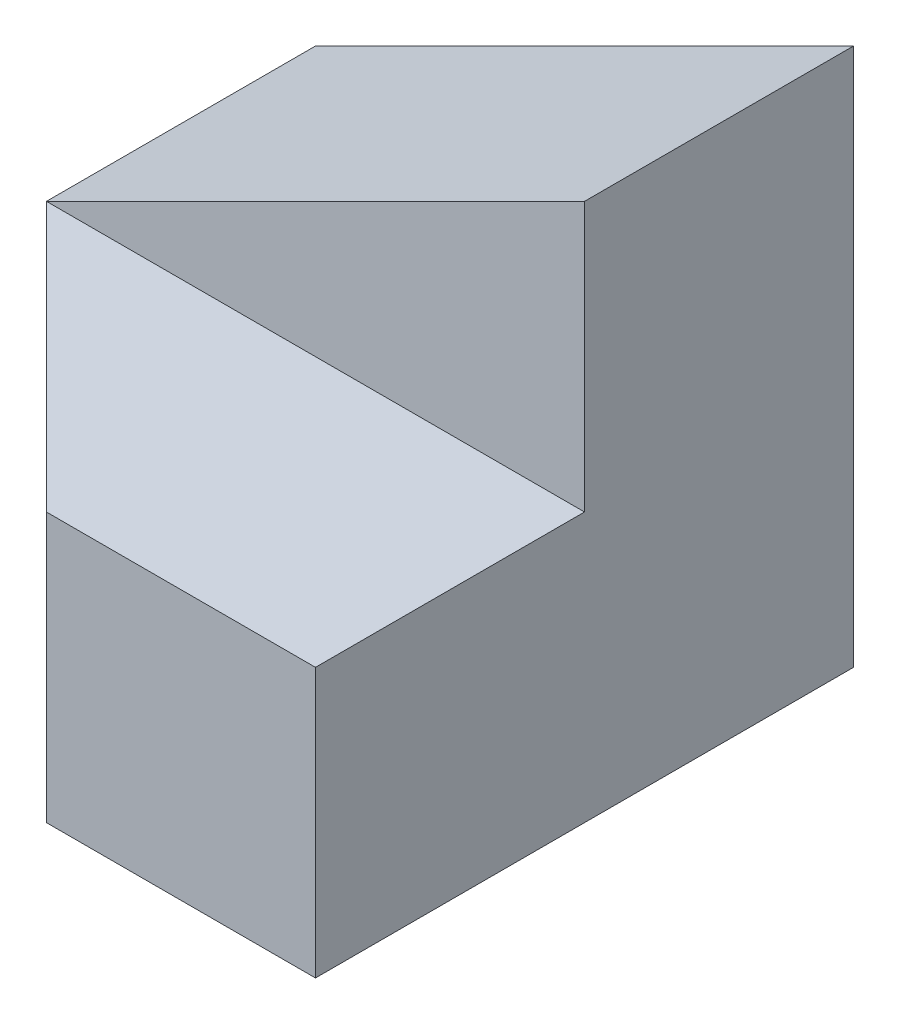
ISO-10303-21;
HEADER;
FILE_DESCRIPTION(('STEP AP214'),'2;1');
FILE_NAME('part.step','',(''),(''),'','','');
FILE_SCHEMA(('AUTOMOTIVE_DESIGN { 1 0 10303 214 1 1 1 1 }'));
ENDSEC;
DATA;
#1=APPLICATION_CONTEXT('core data for automotive mechanical design processes');
#2=APPLICATION_PROTOCOL_DEFINITION('international standard','automotive_design',2000,#1);
#3=PRODUCT_CONTEXT('',#1,'mechanical');
#4=PRODUCT('Part','Part','',(#3));
#5=PRODUCT_RELATED_PRODUCT_CATEGORY('part','',(#4));
#6=PRODUCT_DEFINITION_FORMATION('','',#4);
#7=PRODUCT_DEFINITION_CONTEXT('part definition',#1,'design');
#8=PRODUCT_DEFINITION('design','',#6,#7);
#9=PRODUCT_DEFINITION_SHAPE('','',#8);
#10=(LENGTH_UNIT() NAMED_UNIT(*) SI_UNIT(.MILLI.,.METRE.));
#11=(NAMED_UNIT(*) PLANE_ANGLE_UNIT() SI_UNIT($,.RADIAN.));
#12=(NAMED_UNIT(*) SI_UNIT($,.STERADIAN.) SOLID_ANGLE_UNIT());
#13=UNCERTAINTY_MEASURE_WITH_UNIT(LENGTH_MEASURE(1.E-05),#10,'distance_accuracy_value','');
#14=(GEOMETRIC_REPRESENTATION_CONTEXT(3) GLOBAL_UNCERTAINTY_ASSIGNED_CONTEXT((#13)) GLOBAL_UNIT_ASSIGNED_CONTEXT((#10,
#11,#12)) REPRESENTATION_CONTEXT('',''));
#15=CARTESIAN_POINT('',(0.,0.,0.));
#16=DIRECTION('',(0.,0.,1.));
#17=DIRECTION('',(1.,0.,0.));
#18=AXIS2_PLACEMENT_3D('',#15,#16,#17);
#19=CARTESIAN_POINT('',(0.,0.,40.));
#20=DIRECTION('',(1.,0.,0.));
#21=DIRECTION('',(0.,0.,-1.));
#22=AXIS2_PLACEMENT_3D('',#19,#20,#21);
#23=PLANE('',#22);
#24=DIRECTION('',(0.,0.,-1.));
#25=VECTOR('',#24,1.);
#26=CARTESIAN_POINT('',(0.,0.,40.));
#27=LINE('',#26,#25);
#28=CARTESIAN_POINT('',(0.,0.,20.));
#29=VERTEX_POINT('',#28);
#30=CARTESIAN_POINT('',(0.,0.,0.));
#31=VERTEX_POINT('',#30);
#32=EDGE_CURVE('E40',#29,#31,#27,.T.);
#33=ORIENTED_EDGE('',*,*,#32,.F.);
#34=DIRECTION('',(0.,1.,0.));
#35=VECTOR('',#34,1.);
#36=CARTESIAN_POINT('',(0.,-20.,20.));
#37=LINE('',#36,#35);
#38=CARTESIAN_POINT('',(0.,20.,20.));
#39=VERTEX_POINT('',#38);
#40=EDGE_CURVE('E125',#29,#39,#37,.T.);
#41=ORIENTED_EDGE('',*,*,#40,.T.);
#42=DIRECTION('',(0.,0.,1.));
#43=VECTOR('',#42,1.);
#44=CARTESIAN_POINT('',(0.,20.,0.));
#45=LINE('',#44,#43);
#46=CARTESIAN_POINT('',(0.,20.,0.));
#47=VERTEX_POINT('',#46);
#48=EDGE_CURVE('E104',#47,#39,#45,.T.);
#49=ORIENTED_EDGE('',*,*,#48,.F.);
#50=DIRECTION('',(0.,-1.,0.));
#51=VECTOR('',#50,1.);
#52=CARTESIAN_POINT('',(0.,0.,0.));
#53=LINE('',#52,#51);
#54=EDGE_CURVE('E81',#47,#31,#53,.T.);
#55=ORIENTED_EDGE('',*,*,#54,.T.);
#56=EDGE_LOOP('',(#33,#41,#49,#55));
#57=FACE_BOUND('',#56,.T.);
#58=ADVANCED_FACE('F33',(#57),#23,.F.);
#59=CARTESIAN_POINT('',(0.,0.,40.));
#60=DIRECTION('',(0.,1.,0.));
#61=DIRECTION('',(0.,0.,1.));
#62=AXIS2_PLACEMENT_3D('',#59,#60,#61);
#63=PLANE('',#62);
#64=DIRECTION('',(1.,0.,0.));
#65=VECTOR('',#64,1.);
#66=CARTESIAN_POINT('',(0.,0.,40.));
#67=LINE('',#66,#65);
#68=CARTESIAN_POINT('',(20.,0.,40.));
#69=VERTEX_POINT('',#68);
#70=CARTESIAN_POINT('',(40.,0.,40.));
#71=VERTEX_POINT('',#70);
#72=EDGE_CURVE('E55',#69,#71,#67,.T.);
#73=ORIENTED_EDGE('',*,*,#72,.F.);
#74=DIRECTION('',(-0.707106781186548,0.,-0.707106781186548));
#75=VECTOR('',#74,1.);
#76=CARTESIAN_POINT('',(10.,0.,30.));
#77=LINE('',#76,#75);
#78=EDGE_CURVE('E123',#69,#29,#77,.T.);
#79=ORIENTED_EDGE('',*,*,#78,.T.);
#80=ORIENTED_EDGE('',*,*,#32,.T.);
#81=DIRECTION('',(1.,0.,0.));
#82=VECTOR('',#81,1.);
#83=CARTESIAN_POINT('',(0.,0.,0.));
#84=LINE('',#83,#82);
#85=CARTESIAN_POINT('',(40.,0.,0.));
#86=VERTEX_POINT('',#85);
#87=EDGE_CURVE('E69',#31,#86,#84,.T.);
#88=ORIENTED_EDGE('',*,*,#87,.T.);
#89=DIRECTION('',(0.,0.,-1.));
#90=VECTOR('',#89,1.);
#91=CARTESIAN_POINT('',(40.,0.,40.));
#92=LINE('',#91,#90);
#93=EDGE_CURVE('E72',#71,#86,#92,.T.);
#94=ORIENTED_EDGE('',*,*,#93,.F.);
#95=EDGE_LOOP('',(#73,#79,#80,#88,#94));
#96=FACE_BOUND('',#95,.T.);
#97=ADVANCED_FACE('F71',(#96),#63,.F.);
#98=CARTESIAN_POINT('',(40.,0.,40.));
#99=DIRECTION('',(-1.,0.,0.));
#100=DIRECTION('',(0.,0.,1.));
#101=AXIS2_PLACEMENT_3D('',#98,#99,#100);
#102=PLANE('',#101);
#103=DIRECTION('',(0.,0.,-1.));
#104=VECTOR('',#103,1.);
#105=CARTESIAN_POINT('',(40.,40.,40.));
#106=LINE('',#105,#104);
#107=CARTESIAN_POINT('',(40.,40.,20.));
#108=VERTEX_POINT('',#107);
#109=CARTESIAN_POINT('',(40.,40.,0.));
#110=VERTEX_POINT('',#109);
#111=EDGE_CURVE('E89',#108,#110,#106,.T.);
#112=ORIENTED_EDGE('',*,*,#111,.F.);
#113=DIRECTION('',(0.,1.,0.));
#114=VECTOR('',#113,1.);
#115=CARTESIAN_POINT('',(40.,40.,20.));
#116=LINE('',#115,#114);
#117=CARTESIAN_POINT('',(40.,20.,20.));
#118=VERTEX_POINT('',#117);
#119=EDGE_CURVE('E115',#118,#108,#116,.T.);
#120=ORIENTED_EDGE('',*,*,#119,.F.);
#121=DIRECTION('',(0.,0.,-1.));
#122=VECTOR('',#121,1.);
#123=CARTESIAN_POINT('',(40.,20.,40.));
#124=LINE('',#123,#122);
#125=CARTESIAN_POINT('',(40.,20.,40.));
#126=VERTEX_POINT('',#125);
#127=EDGE_CURVE('E120',#126,#118,#124,.T.);
#128=ORIENTED_EDGE('',*,*,#127,.F.);
#129=DIRECTION('',(0.,1.,0.));
#130=VECTOR('',#129,1.);
#131=CARTESIAN_POINT('',(40.,0.,40.));
#132=LINE('',#131,#130);
#133=EDGE_CURVE('E88',#71,#126,#132,.T.);
#134=ORIENTED_EDGE('',*,*,#133,.F.);
#135=ORIENTED_EDGE('',*,*,#93,.T.);
#136=DIRECTION('',(0.,1.,0.));
#137=VECTOR('',#136,1.);
#138=CARTESIAN_POINT('',(40.,0.,0.));
#139=LINE('',#138,#137);
#140=EDGE_CURVE('E80',#86,#110,#139,.T.);
#141=ORIENTED_EDGE('',*,*,#140,.T.);
#142=EDGE_LOOP('',(#112,#120,#128,#134,#135,#141));
#143=FACE_BOUND('',#142,.T.);
#144=ADVANCED_FACE('F86',(#143),#102,.F.);
#145=CARTESIAN_POINT('',(0.,0.,40.));
#146=DIRECTION('',(0.,0.,-1.));
#147=DIRECTION('',(-1.,0.,0.));
#148=AXIS2_PLACEMENT_3D('',#145,#146,#147);
#149=PLANE('',#148);
#150=DIRECTION('',(1.,0.,0.));
#151=VECTOR('',#150,1.);
#152=CARTESIAN_POINT('',(0.,20.,40.));
#153=LINE('',#152,#151);
#154=CARTESIAN_POINT('',(20.,20.,40.));
#155=VERTEX_POINT('',#154);
#156=EDGE_CURVE('E112',#155,#126,#153,.T.);
#157=ORIENTED_EDGE('',*,*,#156,.F.);
#158=DIRECTION('',(0.,1.,0.));
#159=VECTOR('',#158,1.);
#160=CARTESIAN_POINT('',(20.,-20.,40.));
#161=LINE('',#160,#159);
#162=EDGE_CURVE('E47',#69,#155,#161,.T.);
#163=ORIENTED_EDGE('',*,*,#162,.F.);
#164=ORIENTED_EDGE('',*,*,#72,.T.);
#165=ORIENTED_EDGE('',*,*,#133,.T.);
#166=EDGE_LOOP('',(#157,#163,#164,#165));
#167=FACE_BOUND('',#166,.T.);
#168=ADVANCED_FACE('F149',(#167),#149,.F.);
#169=CARTESIAN_POINT('',(0.,0.,0.));
#170=DIRECTION('',(0.,0.,-1.));
#171=DIRECTION('',(-1.,0.,0.));
#172=AXIS2_PLACEMENT_3D('',#169,#170,#171);
#173=PLANE('',#172);
#174=DIRECTION('',(0.894427190999916,0.447213595499958,0.));
#175=VECTOR('',#174,1.);
#176=CARTESIAN_POINT('',(40.,40.,0.));
#177=LINE('',#176,#175);
#178=EDGE_CURVE('E94',#47,#110,#177,.T.);
#179=ORIENTED_EDGE('',*,*,#178,.T.);
#180=ORIENTED_EDGE('',*,*,#140,.F.);
#181=ORIENTED_EDGE('',*,*,#87,.F.);
#182=ORIENTED_EDGE('',*,*,#54,.F.);
#183=EDGE_LOOP('',(#179,#180,#181,#182));
#184=FACE_BOUND('',#183,.T.);
#185=ADVANCED_FACE('F92',(#184),#173,.T.);
#186=CARTESIAN_POINT('',(40.,40.,0.));
#187=DIRECTION('',(0.447213595499958,-0.894427190999916,0.));
#188=DIRECTION('',(0.894427190999916,0.447213595499958,0.));
#189=AXIS2_PLACEMENT_3D('',#186,#187,#188);
#190=PLANE('',#189);
#191=ORIENTED_EDGE('',*,*,#48,.T.);
#192=DIRECTION('',(0.894427190999916,0.447213595499958,0.));
#193=VECTOR('',#192,1.);
#194=CARTESIAN_POINT('',(40.,40.,20.));
#195=LINE('',#194,#193);
#196=EDGE_CURVE('E11',#39,#108,#195,.T.);
#197=ORIENTED_EDGE('',*,*,#196,.T.);
#198=ORIENTED_EDGE('',*,*,#111,.T.);
#199=ORIENTED_EDGE('',*,*,#178,.F.);
#200=EDGE_LOOP('',(#191,#197,#198,#199));
#201=FACE_BOUND('',#200,.T.);
#202=ADVANCED_FACE('F144',(#201),#190,.F.);
#203=CARTESIAN_POINT('',(0.,40.,20.));
#204=DIRECTION('',(0.,0.,-1.));
#205=DIRECTION('',(0.,1.,0.));
#206=AXIS2_PLACEMENT_3D('',#203,#204,#205);
#207=PLANE('',#206);
#208=DIRECTION('',(1.,0.,0.));
#209=VECTOR('',#208,1.);
#210=CARTESIAN_POINT('',(0.,20.,20.));
#211=LINE('',#210,#209);
#212=EDGE_CURVE('E109',#39,#118,#211,.T.);
#213=ORIENTED_EDGE('',*,*,#212,.T.);
#214=ORIENTED_EDGE('',*,*,#119,.T.);
#215=ORIENTED_EDGE('',*,*,#196,.F.);
#216=EDGE_LOOP('',(#213,#214,#215));
#217=FACE_BOUND('',#216,.T.);
#218=ADVANCED_FACE('F142',(#217),#207,.F.);
#219=CARTESIAN_POINT('',(0.,20.,40.));
#220=DIRECTION('',(0.,-1.,0.));
#221=DIRECTION('',(0.,0.,-1.));
#222=AXIS2_PLACEMENT_3D('',#219,#220,#221);
#223=PLANE('',#222);
#224=ORIENTED_EDGE('',*,*,#212,.F.);
#225=DIRECTION('',(-0.707106781186548,0.,-0.707106781186548));
#226=VECTOR('',#225,1.);
#227=CARTESIAN_POINT('',(0.,20.,20.));
#228=LINE('',#227,#226);
#229=EDGE_CURVE('E127',#155,#39,#228,.T.);
#230=ORIENTED_EDGE('',*,*,#229,.F.);
#231=ORIENTED_EDGE('',*,*,#156,.T.);
#232=ORIENTED_EDGE('',*,*,#127,.T.);
#233=EDGE_LOOP('',(#224,#230,#231,#232));
#234=FACE_BOUND('',#233,.T.);
#235=ADVANCED_FACE('F138',(#234),#223,.F.);
#236=CARTESIAN_POINT('',(0.,-20.,20.));
#237=DIRECTION('',(0.707106781186548,0.,-0.707106781186548));
#238=DIRECTION('',(-0.707106781186548,0.,-0.707106781186548));
#239=AXIS2_PLACEMENT_3D('',#236,#237,#238);
#240=PLANE('',#239);
#241=ORIENTED_EDGE('',*,*,#162,.T.);
#242=ORIENTED_EDGE('',*,*,#229,.T.);
#243=ORIENTED_EDGE('',*,*,#40,.F.);
#244=ORIENTED_EDGE('',*,*,#78,.F.);
#245=EDGE_LOOP('',(#241,#242,#243,#244));
#246=FACE_BOUND('',#245,.T.);
#247=ADVANCED_FACE('F131',(#246),#240,.F.);
#248=CLOSED_SHELL('',(#58,#97,#144,#168,#185,#202,#218,#235,#247));
#249=MANIFOLD_SOLID_BREP('B2',#248);
#250=ADVANCED_BREP_SHAPE_REPRESENTATION('',(#18,#249),#14);
#251=SHAPE_DEFINITION_REPRESENTATION(#9,#250);
ENDSEC;
END-ISO-10303-21;
